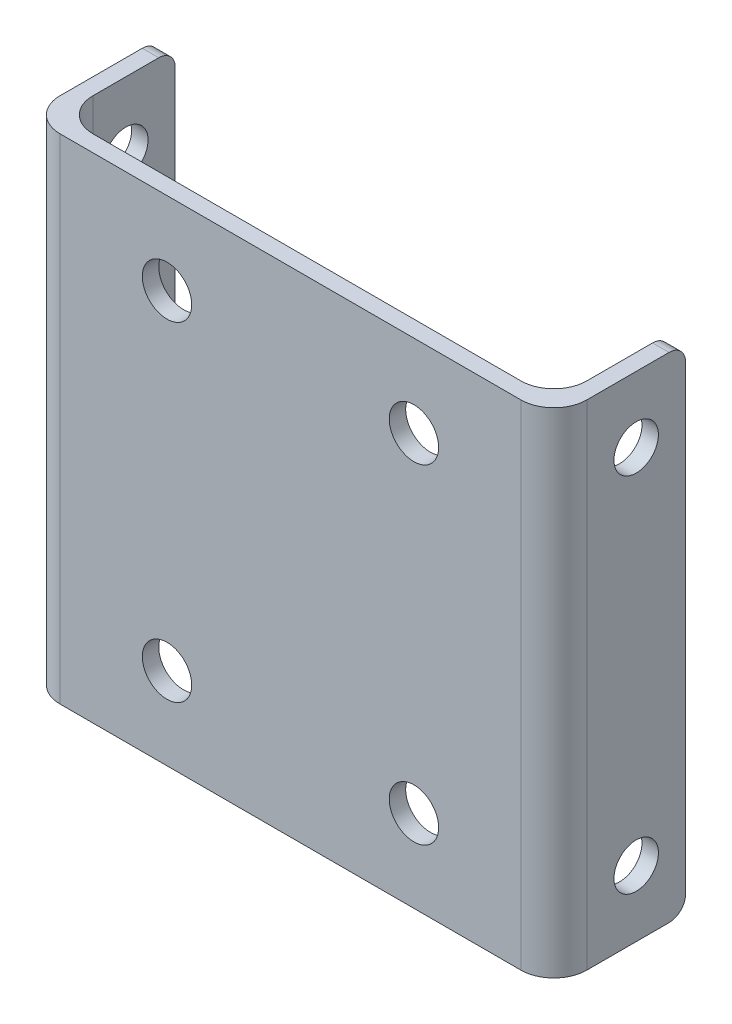
ISO-10303-21;
HEADER;
FILE_DESCRIPTION(('STEP AP214'),'2;1');
FILE_NAME('part.step','',(''),(''),'','','');
FILE_SCHEMA(('AUTOMOTIVE_DESIGN { 1 0 10303 214 1 1 1 1 }'));
ENDSEC;
DATA;
#1=APPLICATION_CONTEXT('core data for automotive mechanical design processes');
#2=APPLICATION_PROTOCOL_DEFINITION('international standard','automotive_design',2000,#1);
#3=PRODUCT_CONTEXT('',#1,'mechanical');
#4=PRODUCT('Part','Part','',(#3));
#5=PRODUCT_RELATED_PRODUCT_CATEGORY('part','',(#4));
#6=PRODUCT_DEFINITION_FORMATION('','',#4);
#7=PRODUCT_DEFINITION_CONTEXT('part definition',#1,'design');
#8=PRODUCT_DEFINITION('design','',#6,#7);
#9=PRODUCT_DEFINITION_SHAPE('','',#8);
#10=(LENGTH_UNIT() NAMED_UNIT(*) SI_UNIT(.MILLI.,.METRE.));
#11=(NAMED_UNIT(*) PLANE_ANGLE_UNIT() SI_UNIT($,.RADIAN.));
#12=(NAMED_UNIT(*) SI_UNIT($,.STERADIAN.) SOLID_ANGLE_UNIT());
#13=UNCERTAINTY_MEASURE_WITH_UNIT(LENGTH_MEASURE(1.E-05),#10,'distance_accuracy_value','');
#14=(GEOMETRIC_REPRESENTATION_CONTEXT(3) GLOBAL_UNCERTAINTY_ASSIGNED_CONTEXT((#13)) GLOBAL_UNIT_ASSIGNED_CONTEXT((#10,
#11,#12)) REPRESENTATION_CONTEXT('',''));
#15=CARTESIAN_POINT('',(0.,0.,0.));
#16=DIRECTION('',(0.,0.,1.));
#17=DIRECTION('',(1.,0.,0.));
#18=AXIS2_PLACEMENT_3D('',#15,#16,#17);
#19=CARTESIAN_POINT('',(9.50000000000006,30.,-0.5));
#20=DIRECTION('',(-1.,0.,0.));
#21=DIRECTION('',(0.,0.,1.));
#22=AXIS2_PLACEMENT_3D('',#19,#20,#21);
#23=PLANE('',#22);
#24=CARTESIAN_POINT('',(9.50000000000006,4.,-4.5));
#25=DIRECTION('',(1.,0.,0.));
#26=DIRECTION('',(0.,0.,-1.));
#27=AXIS2_PLACEMENT_3D('',#24,#25,#26);
#28=CIRCLE('',#27,1.35);
#29=CARTESIAN_POINT('',(9.50000000000006,4.,-5.85));
#30=VERTEX_POINT('',#29);
#31=EDGE_CURVE('E449',#30,#30,#28,.T.);
#32=ORIENTED_EDGE('',*,*,#31,.F.);
#33=EDGE_LOOP('',(#32));
#34=FACE_BOUND('',#33,.T.);
#35=CARTESIAN_POINT('',(9.50000000000006,26.,-4.5));
#36=DIRECTION('',(1.,0.,0.));
#37=DIRECTION('',(0.,0.,-1.));
#38=AXIS2_PLACEMENT_3D('',#35,#36,#37);
#39=CIRCLE('',#38,1.35);
#40=CARTESIAN_POINT('',(9.50000000000006,26.,-5.85));
#41=VERTEX_POINT('',#40);
#42=EDGE_CURVE('E450',#41,#41,#39,.T.);
#43=ORIENTED_EDGE('',*,*,#42,.F.);
#44=EDGE_LOOP('',(#43));
#45=FACE_BOUND('',#44,.T.);
#46=DIRECTION('',(0.,0.,-1.));
#47=VECTOR('',#46,1.);
#48=CARTESIAN_POINT('',(9.50000000000006,0.,-0.5));
#49=LINE('',#48,#47);
#50=CARTESIAN_POINT('',(9.50000000000006,0.,-1.5));
#51=VERTEX_POINT('',#50);
#52=CARTESIAN_POINT('',(9.50000000000006,0.,-6.5));
#53=VERTEX_POINT('',#52);
#54=EDGE_CURVE('E276',#51,#53,#49,.T.);
#55=ORIENTED_EDGE('',*,*,#54,.T.);
#56=CARTESIAN_POINT('',(9.50000000000006,1.,-6.5));
#57=DIRECTION('',(-1.,0.,0.));
#58=DIRECTION('',(0.,0.,1.));
#59=AXIS2_PLACEMENT_3D('',#56,#57,#58);
#60=CIRCLE('',#59,1.);
#61=CARTESIAN_POINT('',(9.50000000000006,1.,-7.5));
#62=VERTEX_POINT('',#61);
#63=EDGE_CURVE('E11',#53,#62,#60,.F.);
#64=ORIENTED_EDGE('',*,*,#63,.T.);
#65=DIRECTION('',(0.,-1.,0.));
#66=VECTOR('',#65,1.);
#67=CARTESIAN_POINT('',(9.50000000000006,30.,-7.5));
#68=LINE('',#67,#66);
#69=CARTESIAN_POINT('',(9.50000000000006,29.,-7.5));
#70=VERTEX_POINT('',#69);
#71=EDGE_CURVE('E192',#70,#62,#68,.T.);
#72=ORIENTED_EDGE('',*,*,#71,.F.);
#73=CARTESIAN_POINT('',(9.50000000000006,29.,-6.5));
#74=DIRECTION('',(-1.,0.,0.));
#75=DIRECTION('',(0.,0.,1.));
#76=AXIS2_PLACEMENT_3D('',#73,#74,#75);
#77=CIRCLE('',#76,1.);
#78=CARTESIAN_POINT('',(9.50000000000006,30.,-6.5));
#79=VERTEX_POINT('',#78);
#80=EDGE_CURVE('E43',#70,#79,#77,.F.);
#81=ORIENTED_EDGE('',*,*,#80,.T.);
#82=DIRECTION('',(0.,0.,-1.));
#83=VECTOR('',#82,1.);
#84=CARTESIAN_POINT('',(9.50000000000006,30.,-0.5));
#85=LINE('',#84,#83);
#86=CARTESIAN_POINT('',(9.50000000000006,30.,-1.5));
#87=VERTEX_POINT('',#86);
#88=EDGE_CURVE('E173',#87,#79,#85,.T.);
#89=ORIENTED_EDGE('',*,*,#88,.F.);
#90=DIRECTION('',(0.,-1.,0.));
#91=VECTOR('',#90,1.);
#92=CARTESIAN_POINT('',(9.50000000000006,30.,-1.5));
#93=LINE('',#92,#91);
#94=EDGE_CURVE('E209',#87,#51,#93,.T.);
#95=ORIENTED_EDGE('',*,*,#94,.T.);
#96=EDGE_LOOP('',(#55,#64,#72,#81,#89,#95));
#97=FACE_BOUND('',#96,.T.);
#98=ADVANCED_FACE('F35',(#34,#45,#97),#23,.F.);
#99=CARTESIAN_POINT('',(9.50000000000006,30.,-7.5));
#100=DIRECTION('',(0.,0.,1.));
#101=DIRECTION('',(1.,0.,0.));
#102=AXIS2_PLACEMENT_3D('',#99,#100,#101);
#103=PLANE('',#102);
#104=ORIENTED_EDGE('',*,*,#71,.T.);
#105=DIRECTION('',(-1.,0.,0.));
#106=VECTOR('',#105,1.);
#107=CARTESIAN_POINT('',(9.50000000000006,1.,-7.5));
#108=LINE('',#107,#106);
#109=CARTESIAN_POINT('',(8.50000000000006,1.,-7.5));
#110=VERTEX_POINT('',#109);
#111=EDGE_CURVE('E248',#62,#110,#108,.T.);
#112=ORIENTED_EDGE('',*,*,#111,.T.);
#113=DIRECTION('',(0.,-1.,0.));
#114=VECTOR('',#113,1.);
#115=CARTESIAN_POINT('',(8.50000000000006,30.,-7.5));
#116=LINE('',#115,#114);
#117=CARTESIAN_POINT('',(8.50000000000006,29.,-7.5));
#118=VERTEX_POINT('',#117);
#119=EDGE_CURVE('E189',#118,#110,#116,.T.);
#120=ORIENTED_EDGE('',*,*,#119,.F.);
#121=DIRECTION('',(-1.,0.,0.));
#122=VECTOR('',#121,1.);
#123=CARTESIAN_POINT('',(9.50000000000006,29.,-7.5));
#124=LINE('',#123,#122);
#125=EDGE_CURVE('E55',#118,#70,#124,.F.);
#126=ORIENTED_EDGE('',*,*,#125,.T.);
#127=EDGE_LOOP('',(#104,#112,#120,#126));
#128=FACE_BOUND('',#127,.T.);
#129=ADVANCED_FACE('F266',(#128),#103,.F.);
#130=CARTESIAN_POINT('',(8.50000000000006,30.,-0.5));
#131=DIRECTION('',(1.,0.,0.));
#132=DIRECTION('',(0.,0.,-1.));
#133=AXIS2_PLACEMENT_3D('',#130,#131,#132);
#134=PLANE('',#133);
#135=CARTESIAN_POINT('',(8.50000000000006,4.,-4.5));
#136=DIRECTION('',(1.,0.,0.));
#137=DIRECTION('',(0.,0.,-1.));
#138=AXIS2_PLACEMENT_3D('',#135,#136,#137);
#139=CIRCLE('',#138,1.35);
#140=CARTESIAN_POINT('',(8.50000000000006,4.,-5.85));
#141=VERTEX_POINT('',#140);
#142=EDGE_CURVE('E373',#141,#141,#139,.T.);
#143=ORIENTED_EDGE('',*,*,#142,.T.);
#144=EDGE_LOOP('',(#143));
#145=FACE_BOUND('',#144,.T.);
#146=CARTESIAN_POINT('',(8.50000000000006,26.,-4.5));
#147=DIRECTION('',(1.,0.,0.));
#148=DIRECTION('',(0.,0.,-1.));
#149=AXIS2_PLACEMENT_3D('',#146,#147,#148);
#150=CIRCLE('',#149,1.35);
#151=CARTESIAN_POINT('',(8.50000000000006,26.,-5.85));
#152=VERTEX_POINT('',#151);
#153=EDGE_CURVE('E376',#152,#152,#150,.T.);
#154=ORIENTED_EDGE('',*,*,#153,.T.);
#155=EDGE_LOOP('',(#154));
#156=FACE_BOUND('',#155,.T.);
#157=ORIENTED_EDGE('',*,*,#119,.T.);
#158=CARTESIAN_POINT('',(8.50000000000006,1.,-6.5));
#159=DIRECTION('',(1.,0.,0.));
#160=DIRECTION('',(0.,0.,-1.));
#161=AXIS2_PLACEMENT_3D('',#158,#159,#160);
#162=CIRCLE('',#161,1.);
#163=CARTESIAN_POINT('',(8.50000000000006,0.,-6.5));
#164=VERTEX_POINT('',#163);
#165=EDGE_CURVE('E253',#110,#164,#162,.F.);
#166=ORIENTED_EDGE('',*,*,#165,.T.);
#167=DIRECTION('',(0.,0.,1.));
#168=VECTOR('',#167,1.);
#169=CARTESIAN_POINT('',(8.50000000000006,0.,-0.5));
#170=LINE('',#169,#168);
#171=CARTESIAN_POINT('',(8.50000000000006,0.,-2.5));
#172=VERTEX_POINT('',#171);
#173=EDGE_CURVE('E272',#164,#172,#170,.T.);
#174=ORIENTED_EDGE('',*,*,#173,.T.);
#175=DIRECTION('',(0.,-1.,0.));
#176=VECTOR('',#175,1.);
#177=CARTESIAN_POINT('',(8.50000000000006,30.,-2.5));
#178=LINE('',#177,#176);
#179=CARTESIAN_POINT('',(8.50000000000006,30.,-2.5));
#180=VERTEX_POINT('',#179);
#181=EDGE_CURVE('E212',#172,#180,#178,.F.);
#182=ORIENTED_EDGE('',*,*,#181,.T.);
#183=DIRECTION('',(0.,0.,1.));
#184=VECTOR('',#183,1.);
#185=CARTESIAN_POINT('',(8.50000000000006,30.,-0.5));
#186=LINE('',#185,#184);
#187=CARTESIAN_POINT('',(8.50000000000006,30.,-6.5));
#188=VERTEX_POINT('',#187);
#189=EDGE_CURVE('E177',#188,#180,#186,.T.);
#190=ORIENTED_EDGE('',*,*,#189,.F.);
#191=CARTESIAN_POINT('',(8.50000000000006,29.,-6.5));
#192=DIRECTION('',(1.,0.,0.));
#193=DIRECTION('',(0.,0.,-1.));
#194=AXIS2_PLACEMENT_3D('',#191,#192,#193);
#195=CIRCLE('',#194,1.);
#196=EDGE_CURVE('E251',#188,#118,#195,.F.);
#197=ORIENTED_EDGE('',*,*,#196,.T.);
#198=EDGE_LOOP('',(#157,#166,#174,#182,#190,#197));
#199=FACE_BOUND('',#198,.T.);
#200=ADVANCED_FACE('F265',(#145,#156,#199),#134,.F.);
#201=CARTESIAN_POINT('',(-21.4999999999999,30.,-0.500000000000001));
#202=DIRECTION('',(0.,0.,1.));
#203=DIRECTION('',(1.,0.,0.));
#204=AXIS2_PLACEMENT_3D('',#201,#202,#203);
#205=PLANE('',#204);
#206=CARTESIAN_POINT('',(-13.9999999999999,5.,-0.500000000000001));
#207=DIRECTION('',(0.,0.,1.));
#208=DIRECTION('',(1.,0.,0.));
#209=AXIS2_PLACEMENT_3D('',#206,#207,#208);
#210=CIRCLE('',#209,1.5);
#211=CARTESIAN_POINT('',(-12.4999999999999,5.,-0.500000000000001));
#212=VERTEX_POINT('',#211);
#213=EDGE_CURVE('E382',#212,#212,#210,.T.);
#214=ORIENTED_EDGE('',*,*,#213,.T.);
#215=EDGE_LOOP('',(#214));
#216=FACE_BOUND('',#215,.T.);
#217=CARTESIAN_POINT('',(1.00000000000006,5.,-0.5));
#218=DIRECTION('',(0.,0.,1.));
#219=DIRECTION('',(1.,0.,0.));
#220=AXIS2_PLACEMENT_3D('',#217,#218,#219);
#221=CIRCLE('',#220,1.5);
#222=CARTESIAN_POINT('',(2.50000000000006,5.,-0.5));
#223=VERTEX_POINT('',#222);
#224=EDGE_CURVE('E394',#223,#223,#221,.T.);
#225=ORIENTED_EDGE('',*,*,#224,.T.);
#226=EDGE_LOOP('',(#225));
#227=FACE_BOUND('',#226,.T.);
#228=CARTESIAN_POINT('',(1.00000000000006,25.,-0.5));
#229=DIRECTION('',(0.,0.,1.));
#230=DIRECTION('',(1.,0.,0.));
#231=AXIS2_PLACEMENT_3D('',#228,#229,#230);
#232=CIRCLE('',#231,1.5);
#233=CARTESIAN_POINT('',(2.50000000000005,25.,-0.5));
#234=VERTEX_POINT('',#233);
#235=EDGE_CURVE('E400',#234,#234,#232,.T.);
#236=ORIENTED_EDGE('',*,*,#235,.T.);
#237=EDGE_LOOP('',(#236));
#238=FACE_BOUND('',#237,.T.);
#239=CARTESIAN_POINT('',(-13.9999999999999,25.,-0.500000000000001));
#240=DIRECTION('',(0.,0.,1.));
#241=DIRECTION('',(1.,0.,0.));
#242=AXIS2_PLACEMENT_3D('',#239,#240,#241);
#243=CIRCLE('',#242,1.5);
#244=CARTESIAN_POINT('',(-12.4999999999999,25.,-0.500000000000001));
#245=VERTEX_POINT('',#244);
#246=EDGE_CURVE('E280',#245,#245,#243,.T.);
#247=ORIENTED_EDGE('',*,*,#246,.T.);
#248=EDGE_LOOP('',(#247));
#249=FACE_BOUND('',#248,.T.);
#250=DIRECTION('',(-1.,0.,0.));
#251=VECTOR('',#250,1.);
#252=CARTESIAN_POINT('',(-21.4999999999999,0.,-0.500000000000001));
#253=LINE('',#252,#251);
#254=CARTESIAN_POINT('',(6.50000000000005,0.,-0.5));
#255=VERTEX_POINT('',#254);
#256=CARTESIAN_POINT('',(-19.4999999999999,0.,-0.500000000000001));
#257=VERTEX_POINT('',#256);
#258=EDGE_CURVE('E275',#255,#257,#253,.T.);
#259=ORIENTED_EDGE('',*,*,#258,.T.);
#260=DIRECTION('',(0.,-1.,0.));
#261=VECTOR('',#260,1.);
#262=CARTESIAN_POINT('',(-19.4999999999999,30.,-0.500000000000001));
#263=LINE('',#262,#261);
#264=CARTESIAN_POINT('',(-19.4999999999999,30.,-0.500000000000001));
#265=VERTEX_POINT('',#264);
#266=EDGE_CURVE('E207',#257,#265,#263,.F.);
#267=ORIENTED_EDGE('',*,*,#266,.T.);
#268=DIRECTION('',(-1.,0.,0.));
#269=VECTOR('',#268,1.);
#270=CARTESIAN_POINT('',(-21.4999999999999,30.,-0.500000000000001));
#271=LINE('',#270,#269);
#272=CARTESIAN_POINT('',(6.50000000000005,30.,-0.5));
#273=VERTEX_POINT('',#272);
#274=EDGE_CURVE('E310',#273,#265,#271,.T.);
#275=ORIENTED_EDGE('',*,*,#274,.F.);
#276=DIRECTION('',(0.,-1.,0.));
#277=VECTOR('',#276,1.);
#278=CARTESIAN_POINT('',(6.50000000000005,0.,-0.5));
#279=LINE('',#278,#277);
#280=EDGE_CURVE('E204',#273,#255,#279,.T.);
#281=ORIENTED_EDGE('',*,*,#280,.T.);
#282=EDGE_LOOP('',(#259,#267,#275,#281));
#283=FACE_BOUND('',#282,.T.);
#284=ADVANCED_FACE('F362',(#216,#227,#238,#249,#283),#205,.F.);
#285=CARTESIAN_POINT('',(-21.4999999999999,30.,-0.500000000000001));
#286=DIRECTION('',(-1.,0.,0.));
#287=DIRECTION('',(0.,0.,1.));
#288=AXIS2_PLACEMENT_3D('',#285,#286,#287);
#289=PLANE('',#288);
#290=CARTESIAN_POINT('',(-21.4999999999999,4.,-4.5));
#291=DIRECTION('',(-1.,0.,0.));
#292=DIRECTION('',(0.,0.,1.));
#293=AXIS2_PLACEMENT_3D('',#290,#291,#292);
#294=CIRCLE('',#293,1.35);
#295=CARTESIAN_POINT('',(-21.4999999999999,4.,-3.15));
#296=VERTEX_POINT('',#295);
#297=EDGE_CURVE('E451',#296,#296,#294,.T.);
#298=ORIENTED_EDGE('',*,*,#297,.T.);
#299=EDGE_LOOP('',(#298));
#300=FACE_BOUND('',#299,.T.);
#301=CARTESIAN_POINT('',(-21.4999999999999,26.,-4.5));
#302=DIRECTION('',(-1.,0.,0.));
#303=DIRECTION('',(0.,0.,1.));
#304=AXIS2_PLACEMENT_3D('',#301,#302,#303);
#305=CIRCLE('',#304,1.35);
#306=CARTESIAN_POINT('',(-21.4999999999999,26.,-3.15));
#307=VERTEX_POINT('',#306);
#308=EDGE_CURVE('E379',#307,#307,#305,.T.);
#309=ORIENTED_EDGE('',*,*,#308,.T.);
#310=EDGE_LOOP('',(#309));
#311=FACE_BOUND('',#310,.T.);
#312=DIRECTION('',(0.,-1.,0.));
#313=VECTOR('',#312,1.);
#314=CARTESIAN_POINT('',(-21.4999999999999,30.,-7.5));
#315=LINE('',#314,#313);
#316=CARTESIAN_POINT('',(-21.4999999999999,29.,-7.5));
#317=VERTEX_POINT('',#316);
#318=CARTESIAN_POINT('',(-21.4999999999999,1.,-7.5));
#319=VERTEX_POINT('',#318);
#320=EDGE_CURVE('E186',#317,#319,#315,.T.);
#321=ORIENTED_EDGE('',*,*,#320,.F.);
#322=CARTESIAN_POINT('',(-21.4999999999999,29.,-6.5));
#323=DIRECTION('',(-1.,0.,0.));
#324=DIRECTION('',(0.,0.,1.));
#325=AXIS2_PLACEMENT_3D('',#322,#323,#324);
#326=CIRCLE('',#325,1.);
#327=CARTESIAN_POINT('',(-21.4999999999999,30.,-6.49999999999999));
#328=VERTEX_POINT('',#327);
#329=EDGE_CURVE('E241',#317,#328,#326,.F.);
#330=ORIENTED_EDGE('',*,*,#329,.T.);
#331=DIRECTION('',(0.,0.,-1.));
#332=VECTOR('',#331,1.);
#333=CARTESIAN_POINT('',(-21.4999999999999,30.,-0.500000000000001));
#334=LINE('',#333,#332);
#335=CARTESIAN_POINT('',(-21.4999999999999,30.,-2.5));
#336=VERTEX_POINT('',#335);
#337=EDGE_CURVE('E307',#336,#328,#334,.T.);
#338=ORIENTED_EDGE('',*,*,#337,.F.);
#339=DIRECTION('',(0.,-1.,0.));
#340=VECTOR('',#339,1.);
#341=CARTESIAN_POINT('',(-21.4999999999999,0.,-2.5));
#342=LINE('',#341,#340);
#343=CARTESIAN_POINT('',(-21.4999999999999,0.,-2.5));
#344=VERTEX_POINT('',#343);
#345=EDGE_CURVE('E201',#336,#344,#342,.T.);
#346=ORIENTED_EDGE('',*,*,#345,.T.);
#347=DIRECTION('',(0.,0.,-1.));
#348=VECTOR('',#347,1.);
#349=CARTESIAN_POINT('',(-21.4999999999999,0.,-0.500000000000001));
#350=LINE('',#349,#348);
#351=CARTESIAN_POINT('',(-21.4999999999999,0.,-6.49999999999999));
#352=VERTEX_POINT('',#351);
#353=EDGE_CURVE('E179',#344,#352,#350,.T.);
#354=ORIENTED_EDGE('',*,*,#353,.T.);
#355=CARTESIAN_POINT('',(-21.4999999999999,1.,-6.5));
#356=DIRECTION('',(-1.,0.,0.));
#357=DIRECTION('',(0.,0.,1.));
#358=AXIS2_PLACEMENT_3D('',#355,#356,#357);
#359=CIRCLE('',#358,1.);
#360=EDGE_CURVE('E239',#352,#319,#359,.F.);
#361=ORIENTED_EDGE('',*,*,#360,.T.);
#362=EDGE_LOOP('',(#321,#330,#338,#346,#354,#361));
#363=FACE_BOUND('',#362,.T.);
#364=ADVANCED_FACE('F288',(#300,#311,#363),#289,.F.);
#365=CARTESIAN_POINT('',(-22.4999999999999,30.,-7.5));
#366=DIRECTION('',(0.,0.,1.));
#367=DIRECTION('',(1.,0.,0.));
#368=AXIS2_PLACEMENT_3D('',#365,#366,#367);
#369=PLANE('',#368);
#370=DIRECTION('',(0.,-1.,0.));
#371=VECTOR('',#370,1.);
#372=CARTESIAN_POINT('',(-22.4999999999999,30.,-7.5));
#373=LINE('',#372,#371);
#374=CARTESIAN_POINT('',(-22.4999999999999,29.,-7.5));
#375=VERTEX_POINT('',#374);
#376=CARTESIAN_POINT('',(-22.4999999999999,1.,-7.5));
#377=VERTEX_POINT('',#376);
#378=EDGE_CURVE('E183',#375,#377,#373,.T.);
#379=ORIENTED_EDGE('',*,*,#378,.F.);
#380=DIRECTION('',(-1.,0.,0.));
#381=VECTOR('',#380,1.);
#382=CARTESIAN_POINT('',(-21.4999999999999,29.,-7.5));
#383=LINE('',#382,#381);
#384=EDGE_CURVE('E237',#375,#317,#383,.F.);
#385=ORIENTED_EDGE('',*,*,#384,.T.);
#386=ORIENTED_EDGE('',*,*,#320,.T.);
#387=DIRECTION('',(-1.,0.,0.));
#388=VECTOR('',#387,1.);
#389=CARTESIAN_POINT('',(-22.4999999999999,1.,-7.5));
#390=LINE('',#389,#388);
#391=EDGE_CURVE('E234',#319,#377,#390,.T.);
#392=ORIENTED_EDGE('',*,*,#391,.T.);
#393=EDGE_LOOP('',(#379,#385,#386,#392));
#394=FACE_BOUND('',#393,.T.);
#395=ADVANCED_FACE('F297',(#394),#369,.F.);
#396=CARTESIAN_POINT('',(-22.4999999999999,30.,-0.499999999999996));
#397=DIRECTION('',(1.,0.,0.));
#398=DIRECTION('',(0.,0.,-1.));
#399=AXIS2_PLACEMENT_3D('',#396,#397,#398);
#400=PLANE('',#399);
#401=CARTESIAN_POINT('',(-22.4999999999999,4.,-4.5));
#402=DIRECTION('',(1.,0.,0.));
#403=DIRECTION('',(0.,0.,-1.));
#404=AXIS2_PLACEMENT_3D('',#401,#402,#403);
#405=CIRCLE('',#404,1.35);
#406=CARTESIAN_POINT('',(-22.4999999999999,4.,-5.85));
#407=VERTEX_POINT('',#406);
#408=EDGE_CURVE('E455',#407,#407,#405,.T.);
#409=ORIENTED_EDGE('',*,*,#408,.T.);
#410=EDGE_LOOP('',(#409));
#411=FACE_BOUND('',#410,.T.);
#412=CARTESIAN_POINT('',(-22.4999999999999,26.,-4.5));
#413=DIRECTION('',(1.,0.,0.));
#414=DIRECTION('',(0.,0.,-1.));
#415=AXIS2_PLACEMENT_3D('',#412,#413,#414);
#416=CIRCLE('',#415,1.35);
#417=CARTESIAN_POINT('',(-22.4999999999999,26.,-5.85));
#418=VERTEX_POINT('',#417);
#419=EDGE_CURVE('E385',#418,#418,#416,.T.);
#420=ORIENTED_EDGE('',*,*,#419,.T.);
#421=EDGE_LOOP('',(#420));
#422=FACE_BOUND('',#421,.T.);
#423=DIRECTION('',(0.,0.,1.));
#424=VECTOR('',#423,1.);
#425=CARTESIAN_POINT('',(-22.4999999999999,30.,-0.499999999999996));
#426=LINE('',#425,#424);
#427=CARTESIAN_POINT('',(-22.4999999999999,30.,-6.5));
#428=VERTEX_POINT('',#427);
#429=CARTESIAN_POINT('',(-22.4999999999999,30.,-1.5));
#430=VERTEX_POINT('',#429);
#431=EDGE_CURVE('E302',#428,#430,#426,.T.);
#432=ORIENTED_EDGE('',*,*,#431,.F.);
#433=CARTESIAN_POINT('',(-22.4999999999999,29.,-6.5));
#434=DIRECTION('',(1.,0.,0.));
#435=DIRECTION('',(0.,0.,-1.));
#436=AXIS2_PLACEMENT_3D('',#433,#434,#435);
#437=CIRCLE('',#436,1.);
#438=EDGE_CURVE('E232',#428,#375,#437,.F.);
#439=ORIENTED_EDGE('',*,*,#438,.T.);
#440=ORIENTED_EDGE('',*,*,#378,.T.);
#441=CARTESIAN_POINT('',(-22.4999999999999,1.,-6.5));
#442=DIRECTION('',(1.,0.,0.));
#443=DIRECTION('',(0.,0.,-1.));
#444=AXIS2_PLACEMENT_3D('',#441,#442,#443);
#445=CIRCLE('',#444,1.);
#446=CARTESIAN_POINT('',(-22.4999999999999,0.,-6.5));
#447=VERTEX_POINT('',#446);
#448=EDGE_CURVE('E230',#377,#447,#445,.F.);
#449=ORIENTED_EDGE('',*,*,#448,.T.);
#450=DIRECTION('',(0.,0.,1.));
#451=VECTOR('',#450,1.);
#452=CARTESIAN_POINT('',(-22.4999999999999,0.,-0.499999999999996));
#453=LINE('',#452,#451);
#454=CARTESIAN_POINT('',(-22.4999999999999,0.,-1.5));
#455=VERTEX_POINT('',#454);
#456=EDGE_CURVE('E174',#447,#455,#453,.T.);
#457=ORIENTED_EDGE('',*,*,#456,.T.);
#458=DIRECTION('',(0.,-1.,0.));
#459=VECTOR('',#458,1.);
#460=CARTESIAN_POINT('',(-22.4999999999999,30.,-1.5));
#461=LINE('',#460,#459);
#462=EDGE_CURVE('E155',#455,#430,#461,.F.);
#463=ORIENTED_EDGE('',*,*,#462,.T.);
#464=EDGE_LOOP('',(#432,#439,#440,#449,#457,#463));
#465=FACE_BOUND('',#464,.T.);
#466=ADVANCED_FACE('F301',(#411,#422,#465),#400,.F.);
#467=CARTESIAN_POINT('',(-22.4999999999999,30.,0.499999999999999));
#468=DIRECTION('',(0.,0.,-1.));
#469=DIRECTION('',(-1.,0.,0.));
#470=AXIS2_PLACEMENT_3D('',#467,#468,#469);
#471=PLANE('',#470);
#472=CARTESIAN_POINT('',(-13.9999999999999,5.,0.5));
#473=DIRECTION('',(0.,0.,1.));
#474=DIRECTION('',(1.,0.,0.));
#475=AXIS2_PLACEMENT_3D('',#472,#473,#474);
#476=CIRCLE('',#475,1.5);
#477=CARTESIAN_POINT('',(-12.4999999999999,5.,0.5));
#478=VERTEX_POINT('',#477);
#479=EDGE_CURVE('E378',#478,#478,#476,.T.);
#480=ORIENTED_EDGE('',*,*,#479,.F.);
#481=EDGE_LOOP('',(#480));
#482=FACE_BOUND('',#481,.T.);
#483=CARTESIAN_POINT('',(1.00000000000006,5.,0.5));
#484=DIRECTION('',(0.,0.,1.));
#485=DIRECTION('',(1.,0.,0.));
#486=AXIS2_PLACEMENT_3D('',#483,#484,#485);
#487=CIRCLE('',#486,1.5);
#488=CARTESIAN_POINT('',(2.50000000000006,5.,0.5));
#489=VERTEX_POINT('',#488);
#490=EDGE_CURVE('E391',#489,#489,#487,.T.);
#491=ORIENTED_EDGE('',*,*,#490,.F.);
#492=EDGE_LOOP('',(#491));
#493=FACE_BOUND('',#492,.T.);
#494=CARTESIAN_POINT('',(1.00000000000006,25.,0.5));
#495=DIRECTION('',(0.,0.,1.));
#496=DIRECTION('',(1.,0.,0.));
#497=AXIS2_PLACEMENT_3D('',#494,#495,#496);
#498=CIRCLE('',#497,1.5);
#499=CARTESIAN_POINT('',(2.50000000000005,25.,0.5));
#500=VERTEX_POINT('',#499);
#501=EDGE_CURVE('E397',#500,#500,#498,.T.);
#502=ORIENTED_EDGE('',*,*,#501,.F.);
#503=EDGE_LOOP('',(#502));
#504=FACE_BOUND('',#503,.T.);
#505=CARTESIAN_POINT('',(-13.9999999999999,25.,0.5));
#506=DIRECTION('',(0.,0.,1.));
#507=DIRECTION('',(1.,0.,0.));
#508=AXIS2_PLACEMENT_3D('',#505,#506,#507);
#509=CIRCLE('',#508,1.5);
#510=CARTESIAN_POINT('',(-12.4999999999999,25.,0.5));
#511=VERTEX_POINT('',#510);
#512=EDGE_CURVE('E403',#511,#511,#509,.T.);
#513=ORIENTED_EDGE('',*,*,#512,.F.);
#514=EDGE_LOOP('',(#513));
#515=FACE_BOUND('',#514,.T.);
#516=DIRECTION('',(1.,0.,0.));
#517=VECTOR('',#516,1.);
#518=CARTESIAN_POINT('',(-22.4999999999999,30.,0.499999999999999));
#519=LINE('',#518,#517);
#520=CARTESIAN_POINT('',(-20.4999999999999,30.,0.499999999999999));
#521=VERTEX_POINT('',#520);
#522=CARTESIAN_POINT('',(7.50000000000006,30.,0.5));
#523=VERTEX_POINT('',#522);
#524=EDGE_CURVE('E168',#521,#523,#519,.T.);
#525=ORIENTED_EDGE('',*,*,#524,.F.);
#526=DIRECTION('',(0.,-1.,0.));
#527=VECTOR('',#526,1.);
#528=CARTESIAN_POINT('',(-20.4999999999999,30.,0.499999999999999));
#529=LINE('',#528,#527);
#530=CARTESIAN_POINT('',(-20.4999999999999,0.,0.499999999999999));
#531=VERTEX_POINT('',#530);
#532=EDGE_CURVE('E153',#521,#531,#529,.T.);
#533=ORIENTED_EDGE('',*,*,#532,.T.);
#534=DIRECTION('',(1.,0.,0.));
#535=VECTOR('',#534,1.);
#536=CARTESIAN_POINT('',(-22.4999999999999,0.,0.499999999999999));
#537=LINE('',#536,#535);
#538=CARTESIAN_POINT('',(7.50000000000006,0.,0.5));
#539=VERTEX_POINT('',#538);
#540=EDGE_CURVE('E165',#531,#539,#537,.T.);
#541=ORIENTED_EDGE('',*,*,#540,.T.);
#542=DIRECTION('',(0.,-1.,0.));
#543=VECTOR('',#542,1.);
#544=CARTESIAN_POINT('',(7.50000000000006,30.,0.5));
#545=LINE('',#544,#543);
#546=EDGE_CURVE('E169',#539,#523,#545,.F.);
#547=ORIENTED_EDGE('',*,*,#546,.T.);
#548=EDGE_LOOP('',(#525,#533,#541,#547));
#549=FACE_BOUND('',#548,.T.);
#550=ADVANCED_FACE('F164',(#482,#493,#504,#515,#549),#471,.F.);
#551=CARTESIAN_POINT('',(0.,30.,0.));
#552=DIRECTION('',(0.,1.,0.));
#553=DIRECTION('',(0.,0.,1.));
#554=AXIS2_PLACEMENT_3D('',#551,#552,#553);
#555=PLANE('',#554);
#556=ORIENTED_EDGE('',*,*,#337,.T.);
#557=DIRECTION('',(-1.,0.,0.));
#558=VECTOR('',#557,1.);
#559=CARTESIAN_POINT('',(-22.4999999999999,30.,-6.5));
#560=LINE('',#559,#558);
#561=EDGE_CURVE('E227',#328,#428,#560,.T.);
#562=ORIENTED_EDGE('',*,*,#561,.T.);
#563=ORIENTED_EDGE('',*,*,#431,.T.);
#564=CARTESIAN_POINT('',(-20.4999999999999,30.,-1.5));
#565=DIRECTION('',(0.,1.,0.));
#566=DIRECTION('',(0.,0.,1.));
#567=AXIS2_PLACEMENT_3D('',#564,#565,#566);
#568=CIRCLE('',#567,2.);
#569=EDGE_CURVE('E199',#430,#521,#568,.T.);
#570=ORIENTED_EDGE('',*,*,#569,.T.);
#571=ORIENTED_EDGE('',*,*,#524,.T.);
#572=CARTESIAN_POINT('',(7.50000000000006,30.,-1.5));
#573=DIRECTION('',(0.,1.,0.));
#574=DIRECTION('',(0.,0.,1.));
#575=AXIS2_PLACEMENT_3D('',#572,#573,#574);
#576=CIRCLE('',#575,2.);
#577=EDGE_CURVE('E197',#523,#87,#576,.T.);
#578=ORIENTED_EDGE('',*,*,#577,.T.);
#579=ORIENTED_EDGE('',*,*,#88,.T.);
#580=DIRECTION('',(-1.,0.,0.));
#581=VECTOR('',#580,1.);
#582=CARTESIAN_POINT('',(8.50000000000006,30.,-6.5));
#583=LINE('',#582,#581);
#584=EDGE_CURVE('E224',#79,#188,#583,.T.);
#585=ORIENTED_EDGE('',*,*,#584,.T.);
#586=ORIENTED_EDGE('',*,*,#189,.T.);
#587=CARTESIAN_POINT('',(6.50000000000005,30.,-2.5));
#588=DIRECTION('',(0.,1.,0.));
#589=DIRECTION('',(0.,0.,1.));
#590=AXIS2_PLACEMENT_3D('',#587,#588,#589);
#591=CIRCLE('',#590,2.);
#592=EDGE_CURVE('E222',#180,#273,#591,.F.);
#593=ORIENTED_EDGE('',*,*,#592,.T.);
#594=ORIENTED_EDGE('',*,*,#274,.T.);
#595=CARTESIAN_POINT('',(-19.4999999999999,30.,-2.5));
#596=DIRECTION('',(0.,1.,0.));
#597=DIRECTION('',(0.,0.,1.));
#598=AXIS2_PLACEMENT_3D('',#595,#596,#597);
#599=CIRCLE('',#598,2.);
#600=EDGE_CURVE('E217',#265,#336,#599,.F.);
#601=ORIENTED_EDGE('',*,*,#600,.T.);
#602=EDGE_LOOP('',(#556,#562,#563,#570,#571,#578,#579,#585,#586,#593,#594,#601));
#603=FACE_BOUND('',#602,.T.);
#604=ADVANCED_FACE('F261',(#603),#555,.T.);
#605=CARTESIAN_POINT('',(0.,0.,0.));
#606=DIRECTION('',(0.,1.,0.));
#607=DIRECTION('',(0.,0.,1.));
#608=AXIS2_PLACEMENT_3D('',#605,#606,#607);
#609=PLANE('',#608);
#610=ORIENTED_EDGE('',*,*,#456,.F.);
#611=DIRECTION('',(-1.,0.,0.));
#612=VECTOR('',#611,1.);
#613=CARTESIAN_POINT('',(0.,0.,-6.5));
#614=LINE('',#613,#612);
#615=EDGE_CURVE('E245',#447,#352,#614,.F.);
#616=ORIENTED_EDGE('',*,*,#615,.T.);
#617=ORIENTED_EDGE('',*,*,#353,.F.);
#618=CARTESIAN_POINT('',(-19.4999999999999,0.,-2.5));
#619=DIRECTION('',(0.,1.,0.));
#620=DIRECTION('',(0.,0.,1.));
#621=AXIS2_PLACEMENT_3D('',#618,#619,#620);
#622=CIRCLE('',#621,2.);
#623=EDGE_CURVE('E215',#344,#257,#622,.T.);
#624=ORIENTED_EDGE('',*,*,#623,.T.);
#625=ORIENTED_EDGE('',*,*,#258,.F.);
#626=CARTESIAN_POINT('',(6.50000000000005,0.,-2.5));
#627=DIRECTION('',(0.,1.,0.));
#628=DIRECTION('',(0.,0.,1.));
#629=AXIS2_PLACEMENT_3D('',#626,#627,#628);
#630=CIRCLE('',#629,2.);
#631=EDGE_CURVE('E219',#255,#172,#630,.T.);
#632=ORIENTED_EDGE('',*,*,#631,.T.);
#633=ORIENTED_EDGE('',*,*,#173,.F.);
#634=DIRECTION('',(-1.,0.,0.));
#635=VECTOR('',#634,1.);
#636=CARTESIAN_POINT('',(0.,0.,-6.5));
#637=LINE('',#636,#635);
#638=EDGE_CURVE('E243',#164,#53,#637,.F.);
#639=ORIENTED_EDGE('',*,*,#638,.T.);
#640=ORIENTED_EDGE('',*,*,#54,.F.);
#641=CARTESIAN_POINT('',(7.50000000000006,0.,-1.5));
#642=DIRECTION('',(0.,1.,0.));
#643=DIRECTION('',(0.,0.,1.));
#644=AXIS2_PLACEMENT_3D('',#641,#642,#643);
#645=CIRCLE('',#644,2.);
#646=EDGE_CURVE('E159',#51,#539,#645,.F.);
#647=ORIENTED_EDGE('',*,*,#646,.T.);
#648=ORIENTED_EDGE('',*,*,#540,.F.);
#649=CARTESIAN_POINT('',(-20.4999999999999,0.,-1.5));
#650=DIRECTION('',(0.,1.,0.));
#651=DIRECTION('',(0.,0.,1.));
#652=AXIS2_PLACEMENT_3D('',#649,#650,#651);
#653=CIRCLE('',#652,2.);
#654=EDGE_CURVE('E149',#531,#455,#653,.F.);
#655=ORIENTED_EDGE('',*,*,#654,.T.);
#656=EDGE_LOOP('',(#610,#616,#617,#624,#625,#632,#633,#639,#640,#647,#648,#655));
#657=FACE_BOUND('',#656,.T.);
#658=ADVANCED_FACE('F171',(#657),#609,.F.);
#659=CARTESIAN_POINT('',(-20.4999999999999,30.,-1.5));
#660=DIRECTION('',(0.,-1.,0.));
#661=DIRECTION('',(0.,0.,-1.));
#662=AXIS2_PLACEMENT_3D('',#659,#660,#661);
#663=CYLINDRICAL_SURFACE('',#662,2.);
#664=ORIENTED_EDGE('',*,*,#569,.F.);
#665=ORIENTED_EDGE('',*,*,#462,.F.);
#666=ORIENTED_EDGE('',*,*,#654,.F.);
#667=ORIENTED_EDGE('',*,*,#532,.F.);
#668=EDGE_LOOP('',(#664,#665,#666,#667));
#669=FACE_BOUND('',#668,.T.);
#670=ADVANCED_FACE('F152',(#669),#663,.T.);
#671=CARTESIAN_POINT('',(-19.4999999999999,30.,-2.5));
#672=DIRECTION('',(0.,1.,0.));
#673=DIRECTION('',(0.,0.,1.));
#674=AXIS2_PLACEMENT_3D('',#671,#672,#673);
#675=CYLINDRICAL_SURFACE('',#674,2.);
#676=ORIENTED_EDGE('',*,*,#600,.F.);
#677=ORIENTED_EDGE('',*,*,#266,.F.);
#678=ORIENTED_EDGE('',*,*,#623,.F.);
#679=ORIENTED_EDGE('',*,*,#345,.F.);
#680=EDGE_LOOP('',(#676,#677,#678,#679));
#681=FACE_BOUND('',#680,.T.);
#682=ADVANCED_FACE('F319',(#681),#675,.F.);
#683=CARTESIAN_POINT('',(7.50000000000006,30.,-1.5));
#684=DIRECTION('',(0.,-1.,0.));
#685=DIRECTION('',(0.,0.,-1.));
#686=AXIS2_PLACEMENT_3D('',#683,#684,#685);
#687=CYLINDRICAL_SURFACE('',#686,2.);
#688=ORIENTED_EDGE('',*,*,#577,.F.);
#689=ORIENTED_EDGE('',*,*,#546,.F.);
#690=ORIENTED_EDGE('',*,*,#646,.F.);
#691=ORIENTED_EDGE('',*,*,#94,.F.);
#692=EDGE_LOOP('',(#688,#689,#690,#691));
#693=FACE_BOUND('',#692,.T.);
#694=ADVANCED_FACE('F316',(#693),#687,.T.);
#695=CARTESIAN_POINT('',(6.50000000000005,30.,-2.5));
#696=DIRECTION('',(0.,1.,0.));
#697=DIRECTION('',(0.,0.,1.));
#698=AXIS2_PLACEMENT_3D('',#695,#696,#697);
#699=CYLINDRICAL_SURFACE('',#698,2.);
#700=ORIENTED_EDGE('',*,*,#592,.F.);
#701=ORIENTED_EDGE('',*,*,#181,.F.);
#702=ORIENTED_EDGE('',*,*,#631,.F.);
#703=ORIENTED_EDGE('',*,*,#280,.F.);
#704=EDGE_LOOP('',(#700,#701,#702,#703));
#705=FACE_BOUND('',#704,.T.);
#706=ADVANCED_FACE('F318',(#705),#699,.F.);
#707=CARTESIAN_POINT('',(-13.9999999999999,25.,-7.5));
#708=DIRECTION('',(0.,0.,1.));
#709=DIRECTION('',(1.,0.,0.));
#710=AXIS2_PLACEMENT_3D('',#707,#708,#709);
#711=CYLINDRICAL_SURFACE('',#710,1.5);
#712=ORIENTED_EDGE('',*,*,#512,.T.);
#713=EDGE_LOOP('',(#712));
#714=FACE_BOUND('',#713,.T.);
#715=ORIENTED_EDGE('',*,*,#246,.F.);
#716=EDGE_LOOP('',(#715));
#717=FACE_BOUND('',#716,.T.);
#718=ADVANCED_FACE('F325',(#714,#717),#711,.F.);
#719=CARTESIAN_POINT('',(1.00000000000006,25.,-7.5));
#720=DIRECTION('',(0.,0.,1.));
#721=DIRECTION('',(1.,0.,0.));
#722=AXIS2_PLACEMENT_3D('',#719,#720,#721);
#723=CYLINDRICAL_SURFACE('',#722,1.5);
#724=ORIENTED_EDGE('',*,*,#501,.T.);
#725=EDGE_LOOP('',(#724));
#726=FACE_BOUND('',#725,.T.);
#727=ORIENTED_EDGE('',*,*,#235,.F.);
#728=EDGE_LOOP('',(#727));
#729=FACE_BOUND('',#728,.T.);
#730=ADVANCED_FACE('F416',(#726,#729),#723,.F.);
#731=CARTESIAN_POINT('',(1.00000000000006,5.,-7.5));
#732=DIRECTION('',(0.,0.,1.));
#733=DIRECTION('',(1.,0.,0.));
#734=AXIS2_PLACEMENT_3D('',#731,#732,#733);
#735=CYLINDRICAL_SURFACE('',#734,1.5);
#736=ORIENTED_EDGE('',*,*,#490,.T.);
#737=EDGE_LOOP('',(#736));
#738=FACE_BOUND('',#737,.T.);
#739=ORIENTED_EDGE('',*,*,#224,.F.);
#740=EDGE_LOOP('',(#739));
#741=FACE_BOUND('',#740,.T.);
#742=ADVANCED_FACE('F421',(#738,#741),#735,.F.);
#743=CARTESIAN_POINT('',(-13.9999999999999,5.,-7.5));
#744=DIRECTION('',(0.,0.,1.));
#745=DIRECTION('',(1.,0.,0.));
#746=AXIS2_PLACEMENT_3D('',#743,#744,#745);
#747=CYLINDRICAL_SURFACE('',#746,1.5);
#748=ORIENTED_EDGE('',*,*,#479,.T.);
#749=EDGE_LOOP('',(#748));
#750=FACE_BOUND('',#749,.T.);
#751=ORIENTED_EDGE('',*,*,#213,.F.);
#752=EDGE_LOOP('',(#751));
#753=FACE_BOUND('',#752,.T.);
#754=ADVANCED_FACE('F427',(#750,#753),#747,.F.);
#755=CARTESIAN_POINT('',(-22.4999999999999,26.,-4.5));
#756=DIRECTION('',(1.,0.,0.));
#757=DIRECTION('',(0.,0.,-1.));
#758=AXIS2_PLACEMENT_3D('',#755,#756,#757);
#759=CYLINDRICAL_SURFACE('',#758,1.35);
#760=ORIENTED_EDGE('',*,*,#419,.F.);
#761=EDGE_LOOP('',(#760));
#762=FACE_BOUND('',#761,.T.);
#763=ORIENTED_EDGE('',*,*,#308,.F.);
#764=EDGE_LOOP('',(#763));
#765=FACE_BOUND('',#764,.T.);
#766=ADVANCED_FACE('F431',(#762,#765),#759,.F.);
#767=ORIENTED_EDGE('',*,*,#42,.T.);
#768=EDGE_LOOP('',(#767));
#769=FACE_BOUND('',#768,.T.);
#770=ORIENTED_EDGE('',*,*,#153,.F.);
#771=EDGE_LOOP('',(#770));
#772=FACE_BOUND('',#771,.T.);
#773=ADVANCED_FACE('F433',(#769,#772),#759,.F.);
#774=CARTESIAN_POINT('',(-22.4999999999999,4.,-4.5));
#775=DIRECTION('',(1.,0.,0.));
#776=DIRECTION('',(0.,0.,-1.));
#777=AXIS2_PLACEMENT_3D('',#774,#775,#776);
#778=CYLINDRICAL_SURFACE('',#777,1.35);
#779=ORIENTED_EDGE('',*,*,#408,.F.);
#780=EDGE_LOOP('',(#779));
#781=FACE_BOUND('',#780,.T.);
#782=ORIENTED_EDGE('',*,*,#297,.F.);
#783=EDGE_LOOP('',(#782));
#784=FACE_BOUND('',#783,.T.);
#785=ADVANCED_FACE('F436',(#781,#784),#778,.F.);
#786=ORIENTED_EDGE('',*,*,#31,.T.);
#787=EDGE_LOOP('',(#786));
#788=FACE_BOUND('',#787,.T.);
#789=ORIENTED_EDGE('',*,*,#142,.F.);
#790=EDGE_LOOP('',(#789));
#791=FACE_BOUND('',#790,.T.);
#792=ADVANCED_FACE('F438',(#788,#791),#778,.F.);
#793=CARTESIAN_POINT('',(0.,29.,-6.5));
#794=DIRECTION('',(1.,0.,0.));
#795=DIRECTION('',(0.,0.,-1.));
#796=AXIS2_PLACEMENT_3D('',#793,#794,#795);
#797=CYLINDRICAL_SURFACE('',#796,1.);
#798=ORIENTED_EDGE('',*,*,#329,.F.);
#799=ORIENTED_EDGE('',*,*,#384,.F.);
#800=ORIENTED_EDGE('',*,*,#438,.F.);
#801=ORIENTED_EDGE('',*,*,#561,.F.);
#802=EDGE_LOOP('',(#798,#799,#800,#801));
#803=FACE_BOUND('',#802,.T.);
#804=ADVANCED_FACE('F306',(#803),#797,.T.);
#805=CARTESIAN_POINT('',(-22.4999999999999,1.,-6.5));
#806=DIRECTION('',(-1.,0.,0.));
#807=DIRECTION('',(0.,0.,1.));
#808=AXIS2_PLACEMENT_3D('',#805,#806,#807);
#809=CYLINDRICAL_SURFACE('',#808,1.);
#810=ORIENTED_EDGE('',*,*,#360,.F.);
#811=ORIENTED_EDGE('',*,*,#615,.F.);
#812=ORIENTED_EDGE('',*,*,#448,.F.);
#813=ORIENTED_EDGE('',*,*,#391,.F.);
#814=EDGE_LOOP('',(#810,#811,#812,#813));
#815=FACE_BOUND('',#814,.T.);
#816=ADVANCED_FACE('F294',(#815),#809,.T.);
#817=CARTESIAN_POINT('',(9.50000000000006,1.,-6.5));
#818=DIRECTION('',(-1.,0.,0.));
#819=DIRECTION('',(0.,0.,1.));
#820=AXIS2_PLACEMENT_3D('',#817,#818,#819);
#821=CYLINDRICAL_SURFACE('',#820,1.);
#822=ORIENTED_EDGE('',*,*,#63,.F.);
#823=ORIENTED_EDGE('',*,*,#638,.F.);
#824=ORIENTED_EDGE('',*,*,#165,.F.);
#825=ORIENTED_EDGE('',*,*,#111,.F.);
#826=EDGE_LOOP('',(#822,#823,#824,#825));
#827=FACE_BOUND('',#826,.T.);
#828=ADVANCED_FACE('F269',(#827),#821,.T.);
#829=CARTESIAN_POINT('',(0.,29.,-6.5));
#830=DIRECTION('',(1.,0.,0.));
#831=DIRECTION('',(0.,0.,-1.));
#832=AXIS2_PLACEMENT_3D('',#829,#830,#831);
#833=CYLINDRICAL_SURFACE('',#832,1.);
#834=ORIENTED_EDGE('',*,*,#80,.F.);
#835=ORIENTED_EDGE('',*,*,#125,.F.);
#836=ORIENTED_EDGE('',*,*,#196,.F.);
#837=ORIENTED_EDGE('',*,*,#584,.F.);
#838=EDGE_LOOP('',(#834,#835,#836,#837));
#839=FACE_BOUND('',#838,.T.);
#840=ADVANCED_FACE('F37',(#839),#833,.T.);
#841=CLOSED_SHELL('',(#98,#129,#200,#284,#364,#395,#466,#550,#604,#658,#670,#682,#694,#706,#718,
#730,#742,#754,#766,#773,#785,#792,#804,#816,#828,#840));
#842=MANIFOLD_SOLID_BREP('B2',#841);
#843=ADVANCED_BREP_SHAPE_REPRESENTATION('',(#18,#842),#14);
#844=SHAPE_DEFINITION_REPRESENTATION(#9,#843);
ENDSEC;
END-ISO-10303-21;
